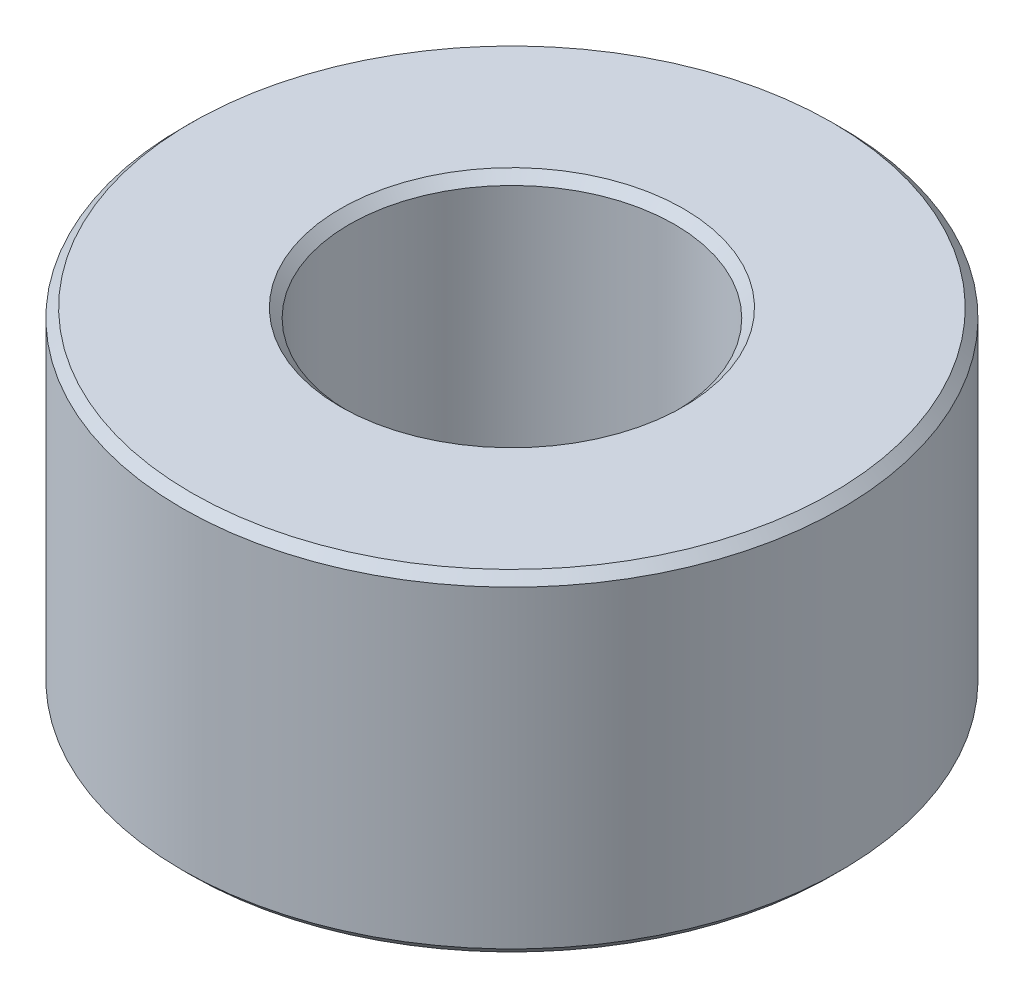
ISO-10303-21;
HEADER;
FILE_DESCRIPTION(('STEP AP214'),'2;1');
FILE_NAME('part.step','',(''),(''),'','','');
FILE_SCHEMA(('AUTOMOTIVE_DESIGN { 1 0 10303 214 1 1 1 1 }'));
ENDSEC;
DATA;
#1=APPLICATION_CONTEXT('core data for automotive mechanical design processes');
#2=APPLICATION_PROTOCOL_DEFINITION('international standard','automotive_design',2000,#1);
#3=PRODUCT_CONTEXT('',#1,'mechanical');
#4=PRODUCT('Part','Part','',(#3));
#5=PRODUCT_RELATED_PRODUCT_CATEGORY('part','',(#4));
#6=PRODUCT_DEFINITION_FORMATION('','',#4);
#7=PRODUCT_DEFINITION_CONTEXT('part definition',#1,'design');
#8=PRODUCT_DEFINITION('design','',#6,#7);
#9=PRODUCT_DEFINITION_SHAPE('','',#8);
#10=(LENGTH_UNIT() NAMED_UNIT(*) SI_UNIT(.MILLI.,.METRE.));
#11=(NAMED_UNIT(*) PLANE_ANGLE_UNIT() SI_UNIT($,.RADIAN.));
#12=(NAMED_UNIT(*) SI_UNIT($,.STERADIAN.) SOLID_ANGLE_UNIT());
#13=UNCERTAINTY_MEASURE_WITH_UNIT(LENGTH_MEASURE(1.E-05),#10,'distance_accuracy_value','');
#14=(GEOMETRIC_REPRESENTATION_CONTEXT(3) GLOBAL_UNCERTAINTY_ASSIGNED_CONTEXT((#13)) GLOBAL_UNIT_ASSIGNED_CONTEXT((#10,
#11,#12)) REPRESENTATION_CONTEXT('',''));
#15=CARTESIAN_POINT('',(0.,0.,0.));
#16=DIRECTION('',(0.,0.,1.));
#17=DIRECTION('',(1.,0.,0.));
#18=AXIS2_PLACEMENT_3D('',#15,#16,#17);
#19=CARTESIAN_POINT('',(0.,25.1331482370044,0.));
#20=DIRECTION('',(0.,-1.,0.));
#21=DIRECTION('',(0.,0.,-1.));
#22=AXIS2_PLACEMENT_3D('',#19,#20,#21);
#23=CYLINDRICAL_SURFACE('',#22,25.);
#24=CARTESIAN_POINT('',(0.,0.684255499951079,0.));
#25=DIRECTION('',(0.,1.,0.));
#26=DIRECTION('',(0.,0.,1.));
#27=AXIS2_PLACEMENT_3D('',#24,#25,#26);
#28=CIRCLE('',#27,25.);
#29=CARTESIAN_POINT('',(0.,0.684255499951079,25.));
#30=VERTEX_POINT('',#29);
#31=EDGE_CURVE('E10',#30,#30,#28,.T.);
#32=ORIENTED_EDGE('',*,*,#31,.T.);
#33=EDGE_LOOP('',(#32));
#34=FACE_BOUND('',#33,.T.);
#35=CARTESIAN_POINT('',(0.,24.4488927370533,0.));
#36=DIRECTION('',(0.,1.,0.));
#37=DIRECTION('',(0.,0.,1.));
#38=AXIS2_PLACEMENT_3D('',#35,#36,#37);
#39=CIRCLE('',#38,25.);
#40=CARTESIAN_POINT('',(0.,24.4488927370533,25.));
#41=VERTEX_POINT('',#40);
#42=EDGE_CURVE('E50',#41,#41,#39,.F.);
#43=ORIENTED_EDGE('',*,*,#42,.T.);
#44=EDGE_LOOP('',(#43));
#45=FACE_BOUND('',#44,.T.);
#46=ADVANCED_FACE('F39',(#34,#45),#23,.T.);
#47=CARTESIAN_POINT('',(0.,25.1331482370044,0.));
#48=DIRECTION('',(0.,1.,0.));
#49=DIRECTION('',(0.,0.,1.));
#50=AXIS2_PLACEMENT_3D('',#47,#48,#49);
#51=PLANE('',#50);
#52=CARTESIAN_POINT('',(0.,25.1331482370044,0.));
#53=DIRECTION('',(0.,1.,0.));
#54=DIRECTION('',(0.,0.,1.));
#55=AXIS2_PLACEMENT_3D('',#52,#53,#54);
#56=CIRCLE('',#55,13.0133883943375);
#57=CARTESIAN_POINT('',(0.,25.1331482370044,13.0133883943375));
#58=VERTEX_POINT('',#57);
#59=EDGE_CURVE('E58',#58,#58,#56,.F.);
#60=ORIENTED_EDGE('',*,*,#59,.T.);
#61=EDGE_LOOP('',(#60));
#62=FACE_BOUND('',#61,.T.);
#63=CARTESIAN_POINT('',(0.,25.1331482370044,0.));
#64=DIRECTION('',(0.,1.,0.));
#65=DIRECTION('',(0.,0.,1.));
#66=AXIS2_PLACEMENT_3D('',#63,#64,#65);
#67=CIRCLE('',#66,24.3157445000489);
#68=CARTESIAN_POINT('',(0.,25.1331482370044,24.3157445000489));
#69=VERTEX_POINT('',#68);
#70=EDGE_CURVE('E61',#69,#69,#67,.T.);
#71=ORIENTED_EDGE('',*,*,#70,.T.);
#72=EDGE_LOOP('',(#71));
#73=FACE_BOUND('',#72,.T.);
#74=ADVANCED_FACE('F88',(#62,#73),#51,.T.);
#75=CARTESIAN_POINT('',(0.,0.,0.));
#76=DIRECTION('',(0.,1.,0.));
#77=DIRECTION('',(0.,0.,1.));
#78=AXIS2_PLACEMENT_3D('',#75,#76,#77);
#79=PLANE('',#78);
#80=CARTESIAN_POINT('',(0.,0.,0.));
#81=DIRECTION('',(0.,1.,0.));
#82=DIRECTION('',(0.,0.,1.));
#83=AXIS2_PLACEMENT_3D('',#80,#81,#82);
#84=CIRCLE('',#83,13.0133883943375);
#85=CARTESIAN_POINT('',(0.,0.,13.0133883943375));
#86=VERTEX_POINT('',#85);
#87=EDGE_CURVE('E51',#86,#86,#84,.T.);
#88=ORIENTED_EDGE('',*,*,#87,.T.);
#89=EDGE_LOOP('',(#88));
#90=FACE_BOUND('',#89,.T.);
#91=CARTESIAN_POINT('',(0.,0.,0.));
#92=DIRECTION('',(0.,1.,0.));
#93=DIRECTION('',(0.,0.,1.));
#94=AXIS2_PLACEMENT_3D('',#91,#92,#93);
#95=CIRCLE('',#94,24.3157445000489);
#96=CARTESIAN_POINT('',(0.,0.,24.3157445000489));
#97=VERTEX_POINT('',#96);
#98=EDGE_CURVE('E54',#97,#97,#95,.F.);
#99=ORIENTED_EDGE('',*,*,#98,.T.);
#100=EDGE_LOOP('',(#99));
#101=FACE_BOUND('',#100,.T.);
#102=ADVANCED_FACE('F83',(#90,#101),#79,.F.);
#103=CARTESIAN_POINT('',(0.,25.1331482370044,0.));
#104=DIRECTION('',(0.,-1.,0.));
#105=DIRECTION('',(0.,0.,-1.));
#106=AXIS2_PLACEMENT_3D('',#103,#104,#105);
#107=CYLINDRICAL_SURFACE('',#106,12.3291328943864);
#108=CARTESIAN_POINT('',(0.,24.4488927370533,0.));
#109=DIRECTION('',(0.,1.,0.));
#110=DIRECTION('',(0.,0.,1.));
#111=AXIS2_PLACEMENT_3D('',#108,#109,#110);
#112=CIRCLE('',#111,12.3291328943864);
#113=CARTESIAN_POINT('',(0.,24.4488927370533,12.3291328943864));
#114=VERTEX_POINT('',#113);
#115=EDGE_CURVE('E67',#114,#114,#112,.T.);
#116=ORIENTED_EDGE('',*,*,#115,.T.);
#117=EDGE_LOOP('',(#116));
#118=FACE_BOUND('',#117,.T.);
#119=CARTESIAN_POINT('',(0.,0.684255499951075,0.));
#120=DIRECTION('',(0.,1.,0.));
#121=DIRECTION('',(0.,0.,1.));
#122=AXIS2_PLACEMENT_3D('',#119,#120,#121);
#123=CIRCLE('',#122,12.3291328943864);
#124=CARTESIAN_POINT('',(0.,0.684255499951075,12.3291328943864));
#125=VERTEX_POINT('',#124);
#126=EDGE_CURVE('E69',#125,#125,#123,.F.);
#127=ORIENTED_EDGE('',*,*,#126,.T.);
#128=EDGE_LOOP('',(#127));
#129=FACE_BOUND('',#128,.T.);
#130=ADVANCED_FACE('F71',(#118,#129),#107,.F.);
#131=CARTESIAN_POINT('',(0.,24.4488927370533,0.));
#132=DIRECTION('',(0.,1.,0.));
#133=DIRECTION('',(0.,0.,1.));
#134=AXIS2_PLACEMENT_3D('',#131,#132,#133);
#135=CONICAL_SURFACE('',#134,12.3291328943864,0.785398163397453);
#136=ORIENTED_EDGE('',*,*,#59,.F.);
#137=EDGE_LOOP('',(#136));
#138=FACE_BOUND('',#137,.T.);
#139=ORIENTED_EDGE('',*,*,#115,.F.);
#140=EDGE_LOOP('',(#139));
#141=FACE_BOUND('',#140,.T.);
#142=ADVANCED_FACE('F77',(#138,#141),#135,.F.);
#143=CARTESIAN_POINT('',(0.,0.,0.));
#144=DIRECTION('',(0.,-1.,0.));
#145=DIRECTION('',(0.,0.,-1.));
#146=AXIS2_PLACEMENT_3D('',#143,#144,#145);
#147=CONICAL_SURFACE('',#146,13.0133883943375,0.785398163397448);
#148=ORIENTED_EDGE('',*,*,#126,.F.);
#149=EDGE_LOOP('',(#148));
#150=FACE_BOUND('',#149,.T.);
#151=ORIENTED_EDGE('',*,*,#87,.F.);
#152=EDGE_LOOP('',(#151));
#153=FACE_BOUND('',#152,.T.);
#154=ADVANCED_FACE('F73',(#150,#153),#147,.F.);
#155=CARTESIAN_POINT('',(0.,0.684255499951079,0.));
#156=DIRECTION('',(0.,1.,0.));
#157=DIRECTION('',(0.,0.,1.));
#158=AXIS2_PLACEMENT_3D('',#155,#156,#157);
#159=CONICAL_SURFACE('',#158,25.,0.785398163397448);
#160=ORIENTED_EDGE('',*,*,#98,.F.);
#161=EDGE_LOOP('',(#160));
#162=FACE_BOUND('',#161,.T.);
#163=ORIENTED_EDGE('',*,*,#31,.F.);
#164=EDGE_LOOP('',(#163));
#165=FACE_BOUND('',#164,.T.);
#166=ADVANCED_FACE('F76',(#162,#165),#159,.T.);
#167=CARTESIAN_POINT('',(0.,25.1331482370044,0.));
#168=DIRECTION('',(0.,-1.,0.));
#169=DIRECTION('',(0.,0.,-1.));
#170=AXIS2_PLACEMENT_3D('',#167,#168,#169);
#171=CONICAL_SURFACE('',#170,24.3157445000489,0.785398163397448);
#172=ORIENTED_EDGE('',*,*,#42,.F.);
#173=EDGE_LOOP('',(#172));
#174=FACE_BOUND('',#173,.T.);
#175=ORIENTED_EDGE('',*,*,#70,.F.);
#176=EDGE_LOOP('',(#175));
#177=FACE_BOUND('',#176,.T.);
#178=ADVANCED_FACE('F45',(#174,#177),#171,.T.);
#179=CLOSED_SHELL('',(#46,#74,#102,#130,#142,#154,#166,#178));
#180=MANIFOLD_SOLID_BREP('B2',#179);
#181=ADVANCED_BREP_SHAPE_REPRESENTATION('',(#18,#180),#14);
#182=SHAPE_DEFINITION_REPRESENTATION(#9,#181);
ENDSEC;
END-ISO-10303-21;
